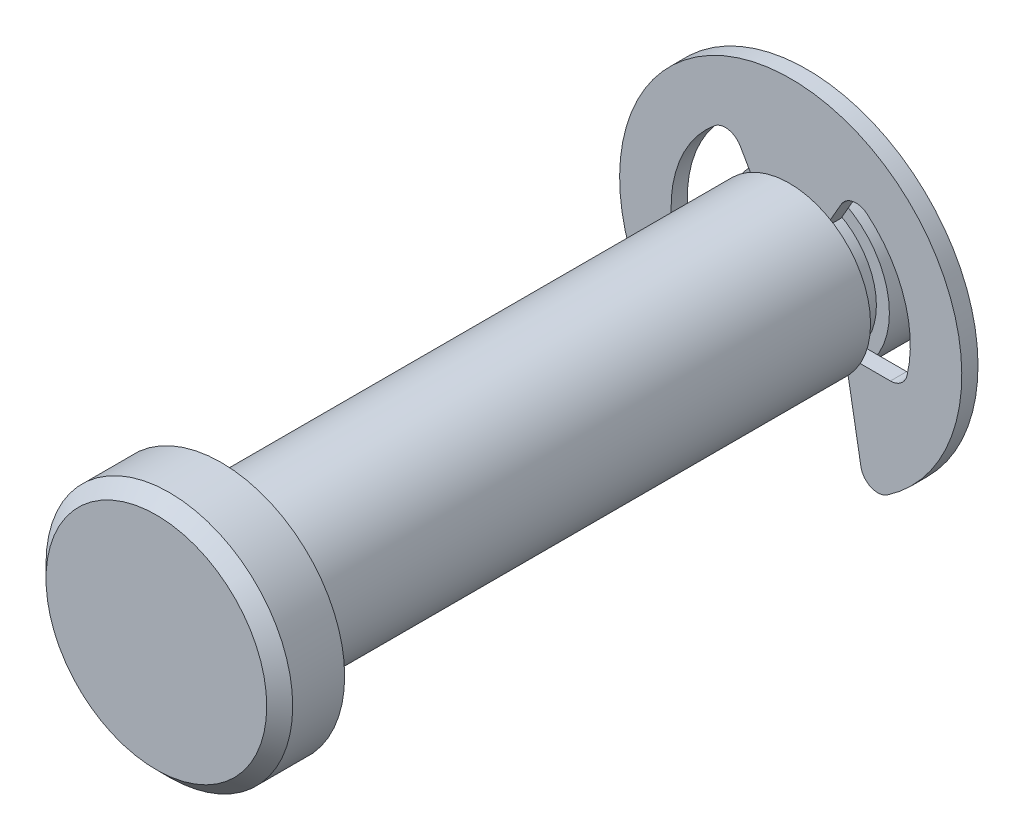
ISO-10303-21;
HEADER;
FILE_DESCRIPTION(('STEP AP214'),'2;1');
FILE_NAME('part.step','',(''),(''),'','','');
FILE_SCHEMA(('AUTOMOTIVE_DESIGN { 1 0 10303 214 1 1 1 1 }'));
ENDSEC;
DATA;
#1=APPLICATION_CONTEXT('core data for automotive mechanical design processes');
#2=APPLICATION_PROTOCOL_DEFINITION('international standard','automotive_design',2000,#1);
#3=PRODUCT_CONTEXT('',#1,'mechanical');
#4=PRODUCT('Part','Part','',(#3));
#5=PRODUCT_RELATED_PRODUCT_CATEGORY('part','',(#4));
#6=PRODUCT_DEFINITION_FORMATION('','',#4);
#7=PRODUCT_DEFINITION_CONTEXT('part definition',#1,'design');
#8=PRODUCT_DEFINITION('design','',#6,#7);
#9=PRODUCT_DEFINITION_SHAPE('','',#8);
#10=(LENGTH_UNIT() NAMED_UNIT(*) SI_UNIT(.MILLI.,.METRE.));
#11=(NAMED_UNIT(*) PLANE_ANGLE_UNIT() SI_UNIT($,.RADIAN.));
#12=(NAMED_UNIT(*) SI_UNIT($,.STERADIAN.) SOLID_ANGLE_UNIT());
#13=UNCERTAINTY_MEASURE_WITH_UNIT(LENGTH_MEASURE(1.E-05),#10,'distance_accuracy_value','');
#14=(GEOMETRIC_REPRESENTATION_CONTEXT(3) GLOBAL_UNCERTAINTY_ASSIGNED_CONTEXT((#13)) GLOBAL_UNIT_ASSIGNED_CONTEXT((#10,
#11,#12)) REPRESENTATION_CONTEXT('',''));
#15=CARTESIAN_POINT('',(0.,0.,0.));
#16=DIRECTION('',(0.,0.,1.));
#17=DIRECTION('',(1.,0.,0.));
#18=AXIS2_PLACEMENT_3D('',#15,#16,#17);
#19=CARTESIAN_POINT('',(0.,0.,-9.5758));
#20=DIRECTION('',(0.,0.,1.));
#21=DIRECTION('',(1.,0.,0.));
#22=AXIS2_PLACEMENT_3D('',#19,#20,#21);
#23=PLANE('',#22);
#24=DIRECTION('',(-0.173648177666931,0.984807753012208,0.));
#25=VECTOR('',#24,1.);
#26=CARTESIAN_POINT('',(1.79561377117954,0.316615154790629,-9.5758));
#27=LINE('',#26,#25);
#28=CARTESIAN_POINT('',(2.74784570227755,-5.08376048410501,-9.5758));
#29=VERTEX_POINT('',#28);
#30=CARTESIAN_POINT('',(2.1336,-1.6002,-9.5758));
#31=VERTEX_POINT('',#30);
#32=EDGE_CURVE('E199',#29,#31,#27,.T.);
#33=ORIENTED_EDGE('',*,*,#32,.F.);
#34=CARTESIAN_POINT('',(3.4069676832911,-4.96753949527431,-9.5758));
#35=DIRECTION('',(0.,0.,1.));
#36=DIRECTION('',(1.,0.,0.));
#37=AXIS2_PLACEMENT_3D('',#34,#35,#36);
#38=CIRCLE('',#37,0.66929);
#39=CARTESIAN_POINT('',(3.78551964810122,-5.51948832808256,-9.5758));
#40=VERTEX_POINT('',#39);
#41=EDGE_CURVE('E253',#29,#40,#38,.T.);
#42=ORIENTED_EDGE('',*,*,#41,.T.);
#43=CARTESIAN_POINT('',(0.,0.,-9.5758));
#44=DIRECTION('',(0.,0.,1.));
#45=DIRECTION('',(1.,0.,0.));
#46=AXIS2_PLACEMENT_3D('',#43,#44,#45);
#47=CIRCLE('',#46,6.6929);
#48=CARTESIAN_POINT('',(-3.78551964810122,-5.51948832808256,-9.5758));
#49=VERTEX_POINT('',#48);
#50=EDGE_CURVE('E179',#40,#49,#47,.T.);
#51=ORIENTED_EDGE('',*,*,#50,.T.);
#52=CARTESIAN_POINT('',(-3.4069676832911,-4.96753949527431,-9.5758));
#53=DIRECTION('',(0.,0.,1.));
#54=DIRECTION('',(1.,0.,0.));
#55=AXIS2_PLACEMENT_3D('',#52,#53,#54);
#56=CIRCLE('',#55,0.66929);
#57=CARTESIAN_POINT('',(-2.74784570227755,-5.08376048410501,-9.5758));
#58=VERTEX_POINT('',#57);
#59=EDGE_CURVE('E251',#49,#58,#56,.T.);
#60=ORIENTED_EDGE('',*,*,#59,.T.);
#61=DIRECTION('',(-0.173648177666931,-0.984807753012208,0.));
#62=VECTOR('',#61,1.);
#63=CARTESIAN_POINT('',(-1.79561377117954,0.316615154790629,-9.5758));
#64=LINE('',#63,#62);
#65=CARTESIAN_POINT('',(-2.1336,-1.6002,-9.5758));
#66=VERTEX_POINT('',#65);
#67=EDGE_CURVE('E195',#66,#58,#64,.T.);
#68=ORIENTED_EDGE('',*,*,#67,.F.);
#69=DIRECTION('',(1.,0.,0.));
#70=VECTOR('',#69,1.);
#71=CARTESIAN_POINT('',(0.,-1.6002,-9.5758));
#72=LINE('',#71,#70);
#73=CARTESIAN_POINT('',(-3.90112806858478,-1.6002,-9.5758));
#74=VERTEX_POINT('',#73);
#75=EDGE_CURVE('E186',#74,#66,#72,.T.);
#76=ORIENTED_EDGE('',*,*,#75,.F.);
#77=CARTESIAN_POINT('',(-3.90112806858478,-0.93091,-9.5758));
#78=DIRECTION('',(0.,0.,1.));
#79=DIRECTION('',(1.,0.,0.));
#80=AXIS2_PLACEMENT_3D('',#77,#78,#79);
#81=CIRCLE('',#80,0.66929);
#82=CARTESIAN_POINT('',(-4.55213962404525,-1.08625818556048,-9.5758));
#83=VERTEX_POINT('',#82);
#84=EDGE_CURVE('E51',#74,#83,#81,.F.);
#85=ORIENTED_EDGE('',*,*,#84,.T.);
#86=CARTESIAN_POINT('',(0.,0.,-9.5758));
#87=DIRECTION('',(0.,0.,1.));
#88=DIRECTION('',(1.,0.,0.));
#89=AXIS2_PLACEMENT_3D('',#86,#87,#88);
#90=CIRCLE('',#89,4.67995);
#91=CARTESIAN_POINT('',(-2.98351110662977,3.60563357527034,-9.5758));
#92=VERTEX_POINT('',#91);
#93=EDGE_CURVE('E211',#92,#83,#90,.T.);
#94=ORIENTED_EDGE('',*,*,#93,.F.);
#95=CARTESIAN_POINT('',(-2.55683258473184,3.08998394320319,-9.5758));
#96=DIRECTION('',(0.,0.,1.));
#97=DIRECTION('',(1.,0.,0.));
#98=AXIS2_PLACEMENT_3D('',#95,#96,#97);
#99=CIRCLE('',#98,0.66929);
#100=CARTESIAN_POINT('',(-1.97721044223295,3.42462894320319,-9.5758));
#101=VERTEX_POINT('',#100);
#102=EDGE_CURVE('E183',#92,#101,#99,.F.);
#103=ORIENTED_EDGE('',*,*,#102,.T.);
#104=DIRECTION('',(-0.500000000000001,0.866025403784438,0.));
#105=VECTOR('',#104,1.);
#106=CARTESIAN_POINT('',(0.,0.,-9.5758));
#107=LINE('',#106,#105);
#108=CARTESIAN_POINT('',(-1.3335,2.30968975189309,-9.5758));
#109=VERTEX_POINT('',#108);
#110=EDGE_CURVE('E175',#109,#101,#107,.T.);
#111=ORIENTED_EDGE('',*,*,#110,.F.);
#112=DIRECTION('',(1.,0.,0.));
#113=VECTOR('',#112,1.);
#114=CARTESIAN_POINT('',(-1.3335,2.30968975189309,-9.5758));
#115=LINE('',#114,#113);
#116=CARTESIAN_POINT('',(1.3335,2.30968975189309,-9.5758));
#117=VERTEX_POINT('',#116);
#118=EDGE_CURVE('E159',#109,#117,#115,.T.);
#119=ORIENTED_EDGE('',*,*,#118,.T.);
#120=DIRECTION('',(-0.500000000000001,-0.866025403784438,0.));
#121=VECTOR('',#120,1.);
#122=CARTESIAN_POINT('',(0.,0.,-9.5758));
#123=LINE('',#122,#121);
#124=CARTESIAN_POINT('',(1.97721044223295,3.42462894320319,-9.5758));
#125=VERTEX_POINT('',#124);
#126=EDGE_CURVE('E209',#125,#117,#123,.T.);
#127=ORIENTED_EDGE('',*,*,#126,.F.);
#128=CARTESIAN_POINT('',(2.55683258473184,3.08998394320319,-9.5758));
#129=DIRECTION('',(0.,0.,1.));
#130=DIRECTION('',(1.,0.,0.));
#131=AXIS2_PLACEMENT_3D('',#128,#129,#130);
#132=CIRCLE('',#131,0.66929);
#133=CARTESIAN_POINT('',(2.98351110662977,3.60563357527034,-9.5758));
#134=VERTEX_POINT('',#133);
#135=EDGE_CURVE('E268',#125,#134,#132,.F.);
#136=ORIENTED_EDGE('',*,*,#135,.T.);
#137=CARTESIAN_POINT('',(0.,0.,-9.5758));
#138=DIRECTION('',(0.,0.,1.));
#139=DIRECTION('',(1.,0.,0.));
#140=AXIS2_PLACEMENT_3D('',#137,#138,#139);
#141=CIRCLE('',#140,4.67995);
#142=CARTESIAN_POINT('',(4.55213962404525,-1.08625818556048,-9.5758));
#143=VERTEX_POINT('',#142);
#144=EDGE_CURVE('E214',#143,#134,#141,.T.);
#145=ORIENTED_EDGE('',*,*,#144,.F.);
#146=CARTESIAN_POINT('',(3.90112806858478,-0.93091,-9.5758));
#147=DIRECTION('',(0.,0.,1.));
#148=DIRECTION('',(1.,0.,0.));
#149=AXIS2_PLACEMENT_3D('',#146,#147,#148);
#150=CIRCLE('',#149,0.66929);
#151=CARTESIAN_POINT('',(3.90112806858478,-1.6002,-9.5758));
#152=VERTEX_POINT('',#151);
#153=EDGE_CURVE('E264',#143,#152,#150,.F.);
#154=ORIENTED_EDGE('',*,*,#153,.T.);
#155=DIRECTION('',(1.,0.,0.));
#156=VECTOR('',#155,1.);
#157=CARTESIAN_POINT('',(0.,-1.6002,-9.5758));
#158=LINE('',#157,#156);
#159=EDGE_CURVE('E204',#31,#152,#158,.T.);
#160=ORIENTED_EDGE('',*,*,#159,.F.);
#161=EDGE_LOOP('',(#33,#42,#51,#60,#68,#76,#85,#94,#103,#111,#119,#127,#136,#145,#154,#160));
#162=FACE_BOUND('',#161,.T.);
#163=ADVANCED_FACE('F43',(#162),#23,.T.);
#164=CARTESIAN_POINT('',(0.,0.,-10.2108));
#165=DIRECTION('',(0.,0.,1.));
#166=DIRECTION('',(1.,0.,0.));
#167=AXIS2_PLACEMENT_3D('',#164,#165,#166);
#168=PLANE('',#167);
#169=CARTESIAN_POINT('',(0.,0.,-10.2108));
#170=DIRECTION('',(0.,0.,1.));
#171=DIRECTION('',(1.,0.,0.));
#172=AXIS2_PLACEMENT_3D('',#169,#170,#171);
#173=CIRCLE('',#172,6.6929);
#174=CARTESIAN_POINT('',(3.78551964810122,-5.51948832808256,-10.2108));
#175=VERTEX_POINT('',#174);
#176=CARTESIAN_POINT('',(-3.78551964810122,-5.51948832808256,-10.2108));
#177=VERTEX_POINT('',#176);
#178=EDGE_CURVE('E217',#175,#177,#173,.T.);
#179=ORIENTED_EDGE('',*,*,#178,.F.);
#180=CARTESIAN_POINT('',(3.4069676832911,-4.96753949527431,-10.2108));
#181=DIRECTION('',(0.,0.,1.));
#182=DIRECTION('',(1.,0.,0.));
#183=AXIS2_PLACEMENT_3D('',#180,#181,#182);
#184=CIRCLE('',#183,0.66929);
#185=CARTESIAN_POINT('',(2.74784570227755,-5.08376048410501,-10.2108));
#186=VERTEX_POINT('',#185);
#187=EDGE_CURVE('E261',#175,#186,#184,.F.);
#188=ORIENTED_EDGE('',*,*,#187,.T.);
#189=DIRECTION('',(-0.173648177666931,0.984807753012208,0.));
#190=VECTOR('',#189,1.);
#191=CARTESIAN_POINT('',(1.79561377117954,0.316615154790629,-10.2108));
#192=LINE('',#191,#190);
#193=CARTESIAN_POINT('',(2.1336,-1.6002,-10.2108));
#194=VERTEX_POINT('',#193);
#195=EDGE_CURVE('E197',#186,#194,#192,.T.);
#196=ORIENTED_EDGE('',*,*,#195,.T.);
#197=DIRECTION('',(1.,0.,0.));
#198=VECTOR('',#197,1.);
#199=CARTESIAN_POINT('',(0.,-1.6002,-10.2108));
#200=LINE('',#199,#198);
#201=CARTESIAN_POINT('',(3.90112806858478,-1.6002,-10.2108));
#202=VERTEX_POINT('',#201);
#203=EDGE_CURVE('E201',#194,#202,#200,.T.);
#204=ORIENTED_EDGE('',*,*,#203,.T.);
#205=CARTESIAN_POINT('',(3.90112806858478,-0.93091,-10.2108));
#206=DIRECTION('',(0.,0.,1.));
#207=DIRECTION('',(1.,0.,0.));
#208=AXIS2_PLACEMENT_3D('',#205,#206,#207);
#209=CIRCLE('',#208,0.66929);
#210=CARTESIAN_POINT('',(4.55213962404525,-1.08625818556048,-10.2108));
#211=VERTEX_POINT('',#210);
#212=EDGE_CURVE('E266',#202,#211,#209,.T.);
#213=ORIENTED_EDGE('',*,*,#212,.T.);
#214=CARTESIAN_POINT('',(0.,0.,-10.2108));
#215=DIRECTION('',(0.,0.,1.));
#216=DIRECTION('',(1.,0.,0.));
#217=AXIS2_PLACEMENT_3D('',#214,#215,#216);
#218=CIRCLE('',#217,4.67995);
#219=CARTESIAN_POINT('',(2.98351110662977,3.60563357527034,-10.2108));
#220=VERTEX_POINT('',#219);
#221=EDGE_CURVE('E225',#211,#220,#218,.T.);
#222=ORIENTED_EDGE('',*,*,#221,.T.);
#223=CARTESIAN_POINT('',(2.55683258473184,3.08998394320319,-10.2108));
#224=DIRECTION('',(0.,0.,1.));
#225=DIRECTION('',(1.,0.,0.));
#226=AXIS2_PLACEMENT_3D('',#223,#224,#225);
#227=CIRCLE('',#226,0.66929);
#228=CARTESIAN_POINT('',(1.97721044223295,3.42462894320319,-10.2108));
#229=VERTEX_POINT('',#228);
#230=EDGE_CURVE('E270',#220,#229,#227,.T.);
#231=ORIENTED_EDGE('',*,*,#230,.T.);
#232=DIRECTION('',(-0.500000000000001,-0.866025403784438,0.));
#233=VECTOR('',#232,1.);
#234=CARTESIAN_POINT('',(0.,0.,-10.2108));
#235=LINE('',#234,#233);
#236=CARTESIAN_POINT('',(1.3335,2.30968975189309,-10.2108));
#237=VERTEX_POINT('',#236);
#238=EDGE_CURVE('E207',#229,#237,#235,.T.);
#239=ORIENTED_EDGE('',*,*,#238,.T.);
#240=DIRECTION('',(-1.,0.,0.));
#241=VECTOR('',#240,1.);
#242=CARTESIAN_POINT('',(-1.3335,2.30968975189309,-10.2108));
#243=LINE('',#242,#241);
#244=CARTESIAN_POINT('',(-1.3335,2.30968975189309,-10.2108));
#245=VERTEX_POINT('',#244);
#246=EDGE_CURVE('E170',#237,#245,#243,.T.);
#247=ORIENTED_EDGE('',*,*,#246,.T.);
#248=DIRECTION('',(-0.500000000000001,0.866025403784438,0.));
#249=VECTOR('',#248,1.);
#250=CARTESIAN_POINT('',(0.,0.,-10.2108));
#251=LINE('',#250,#249);
#252=CARTESIAN_POINT('',(-1.97721044223295,3.42462894320319,-10.2108));
#253=VERTEX_POINT('',#252);
#254=EDGE_CURVE('E178',#245,#253,#251,.T.);
#255=ORIENTED_EDGE('',*,*,#254,.T.);
#256=CARTESIAN_POINT('',(-2.55683258473184,3.08998394320319,-10.2108));
#257=DIRECTION('',(0.,0.,1.));
#258=DIRECTION('',(1.,0.,0.));
#259=AXIS2_PLACEMENT_3D('',#256,#257,#258);
#260=CIRCLE('',#259,0.66929);
#261=CARTESIAN_POINT('',(-2.98351110662977,3.60563357527034,-10.2108));
#262=VERTEX_POINT('',#261);
#263=EDGE_CURVE('E273',#253,#262,#260,.T.);
#264=ORIENTED_EDGE('',*,*,#263,.T.);
#265=CARTESIAN_POINT('',(0.,0.,-10.2108));
#266=DIRECTION('',(0.,0.,1.));
#267=DIRECTION('',(1.,0.,0.));
#268=AXIS2_PLACEMENT_3D('',#265,#266,#267);
#269=CIRCLE('',#268,4.67995);
#270=CARTESIAN_POINT('',(-4.55213962404525,-1.08625818556048,-10.2108));
#271=VERTEX_POINT('',#270);
#272=EDGE_CURVE('E222',#262,#271,#269,.T.);
#273=ORIENTED_EDGE('',*,*,#272,.T.);
#274=CARTESIAN_POINT('',(-3.90112806858478,-0.93091,-10.2108));
#275=DIRECTION('',(0.,0.,1.));
#276=DIRECTION('',(1.,0.,0.));
#277=AXIS2_PLACEMENT_3D('',#274,#275,#276);
#278=CIRCLE('',#277,0.66929);
#279=CARTESIAN_POINT('',(-3.90112806858478,-1.6002,-10.2108));
#280=VERTEX_POINT('',#279);
#281=EDGE_CURVE('E13',#271,#280,#278,.T.);
#282=ORIENTED_EDGE('',*,*,#281,.T.);
#283=DIRECTION('',(1.,0.,0.));
#284=VECTOR('',#283,1.);
#285=CARTESIAN_POINT('',(0.,-1.6002,-10.2108));
#286=LINE('',#285,#284);
#287=CARTESIAN_POINT('',(-2.1336,-1.6002,-10.2108));
#288=VERTEX_POINT('',#287);
#289=EDGE_CURVE('E184',#280,#288,#286,.T.);
#290=ORIENTED_EDGE('',*,*,#289,.T.);
#291=DIRECTION('',(-0.173648177666931,-0.984807753012208,0.));
#292=VECTOR('',#291,1.);
#293=CARTESIAN_POINT('',(-1.79561377117954,0.316615154790629,-10.2108));
#294=LINE('',#293,#292);
#295=CARTESIAN_POINT('',(-2.74784570227755,-5.08376048410501,-10.2108));
#296=VERTEX_POINT('',#295);
#297=EDGE_CURVE('E193',#288,#296,#294,.T.);
#298=ORIENTED_EDGE('',*,*,#297,.T.);
#299=CARTESIAN_POINT('',(-3.4069676832911,-4.96753949527431,-10.2108));
#300=DIRECTION('',(0.,0.,1.));
#301=DIRECTION('',(1.,0.,0.));
#302=AXIS2_PLACEMENT_3D('',#299,#300,#301);
#303=CIRCLE('',#302,0.66929);
#304=EDGE_CURVE('E65',#296,#177,#303,.F.);
#305=ORIENTED_EDGE('',*,*,#304,.T.);
#306=EDGE_LOOP('',(#179,#188,#196,#204,#213,#222,#231,#239,#247,#255,#264,#273,#282,#290,#298,#305));
#307=FACE_BOUND('',#306,.T.);
#308=ADVANCED_FACE('F286',(#307),#168,.F.);
#309=CARTESIAN_POINT('',(0.,0.,-9.5758));
#310=DIRECTION('',(0.,0.,-1.));
#311=DIRECTION('',(-1.,0.,0.));
#312=AXIS2_PLACEMENT_3D('',#309,#310,#311);
#313=CYLINDRICAL_SURFACE('',#312,6.6929);
#314=ORIENTED_EDGE('',*,*,#50,.F.);
#315=DIRECTION('',(0.,0.,-1.));
#316=VECTOR('',#315,1.);
#317=CARTESIAN_POINT('',(3.78551964810122,-5.51948832808256,-9.5758));
#318=LINE('',#317,#316);
#319=EDGE_CURVE('E258',#40,#175,#318,.T.);
#320=ORIENTED_EDGE('',*,*,#319,.T.);
#321=ORIENTED_EDGE('',*,*,#178,.T.);
#322=DIRECTION('',(0.,0.,-1.));
#323=VECTOR('',#322,1.);
#324=CARTESIAN_POINT('',(-3.78551964810122,-5.51948832808256,-9.5758));
#325=LINE('',#324,#323);
#326=EDGE_CURVE('E255',#177,#49,#325,.F.);
#327=ORIENTED_EDGE('',*,*,#326,.T.);
#328=EDGE_LOOP('',(#314,#320,#321,#327));
#329=FACE_BOUND('',#328,.T.);
#330=ADVANCED_FACE('F326',(#329),#313,.T.);
#331=CARTESIAN_POINT('',(-2.1336,-1.6002,-12.7));
#332=DIRECTION('',(-0.984807753012208,0.173648177666931,0.));
#333=DIRECTION('',(-0.173648177666931,-0.984807753012208,0.));
#334=AXIS2_PLACEMENT_3D('',#331,#332,#333);
#335=PLANE('',#334);
#336=ORIENTED_EDGE('',*,*,#67,.T.);
#337=DIRECTION('',(0.,0.,-1.));
#338=VECTOR('',#337,1.);
#339=CARTESIAN_POINT('',(-2.74784570227755,-5.08376048410501,-12.7));
#340=LINE('',#339,#338);
#341=EDGE_CURVE('E58',#58,#296,#340,.T.);
#342=ORIENTED_EDGE('',*,*,#341,.T.);
#343=ORIENTED_EDGE('',*,*,#297,.F.);
#344=DIRECTION('',(0.,0.,1.));
#345=VECTOR('',#344,1.);
#346=CARTESIAN_POINT('',(-2.1336,-1.6002,-12.7));
#347=LINE('',#346,#345);
#348=EDGE_CURVE('E291',#288,#66,#347,.T.);
#349=ORIENTED_EDGE('',*,*,#348,.T.);
#350=EDGE_LOOP('',(#336,#342,#343,#349));
#351=FACE_BOUND('',#350,.T.);
#352=ADVANCED_FACE('F331',(#351),#335,.F.);
#353=CARTESIAN_POINT('',(-2.33997500000001,4.05295558844098,-12.7));
#354=DIRECTION('',(0.866025403784438,0.500000000000001,0.));
#355=DIRECTION('',(-0.500000000000001,0.866025403784438,0.));
#356=AXIS2_PLACEMENT_3D('',#353,#354,#355);
#357=PLANE('',#356);
#358=ORIENTED_EDGE('',*,*,#110,.T.);
#359=DIRECTION('',(0.,0.,-1.));
#360=VECTOR('',#359,1.);
#361=CARTESIAN_POINT('',(-1.97721044223295,3.42462894320319,-10.2108));
#362=LINE('',#361,#360);
#363=EDGE_CURVE('E243',#101,#253,#362,.T.);
#364=ORIENTED_EDGE('',*,*,#363,.T.);
#365=ORIENTED_EDGE('',*,*,#254,.F.);
#366=DIRECTION('',(0.,0.,-1.));
#367=VECTOR('',#366,1.);
#368=CARTESIAN_POINT('',(-1.3335,2.30968975189309,-9.5758));
#369=LINE('',#368,#367);
#370=EDGE_CURVE('E163',#245,#109,#369,.F.);
#371=ORIENTED_EDGE('',*,*,#370,.T.);
#372=EDGE_LOOP('',(#358,#364,#365,#371));
#373=FACE_BOUND('',#372,.T.);
#374=ADVANCED_FACE('F174',(#373),#357,.F.);
#375=CARTESIAN_POINT('',(0.,0.,-12.7));
#376=DIRECTION('',(0.,0.,1.));
#377=DIRECTION('',(1.,0.,0.));
#378=AXIS2_PLACEMENT_3D('',#375,#376,#377);
#379=CYLINDRICAL_SURFACE('',#378,4.67995);
#380=ORIENTED_EDGE('',*,*,#272,.F.);
#381=DIRECTION('',(0.,0.,1.));
#382=VECTOR('',#381,1.);
#383=CARTESIAN_POINT('',(-2.98351110662977,3.60563357527034,-12.7));
#384=LINE('',#383,#382);
#385=EDGE_CURVE('E240',#262,#92,#384,.T.);
#386=ORIENTED_EDGE('',*,*,#385,.T.);
#387=ORIENTED_EDGE('',*,*,#93,.T.);
#388=DIRECTION('',(0.,0.,1.));
#389=VECTOR('',#388,1.);
#390=CARTESIAN_POINT('',(-4.55213962404525,-1.08625818556048,-12.7));
#391=LINE('',#390,#389);
#392=EDGE_CURVE('E238',#83,#271,#391,.F.);
#393=ORIENTED_EDGE('',*,*,#392,.T.);
#394=EDGE_LOOP('',(#380,#386,#387,#393));
#395=FACE_BOUND('',#394,.T.);
#396=ADVANCED_FACE('F281',(#395),#379,.F.);
#397=CARTESIAN_POINT('',(-4.39787357281903,-1.6002,-12.7));
#398=DIRECTION('',(0.,-1.,0.));
#399=DIRECTION('',(0.,0.,-1.));
#400=AXIS2_PLACEMENT_3D('',#397,#398,#399);
#401=PLANE('',#400);
#402=ORIENTED_EDGE('',*,*,#289,.F.);
#403=DIRECTION('',(0.,0.,-1.));
#404=VECTOR('',#403,1.);
#405=CARTESIAN_POINT('',(-3.90112806858478,-1.6002,-9.5758));
#406=LINE('',#405,#404);
#407=EDGE_CURVE('E245',#280,#74,#406,.F.);
#408=ORIENTED_EDGE('',*,*,#407,.T.);
#409=ORIENTED_EDGE('',*,*,#75,.T.);
#410=ORIENTED_EDGE('',*,*,#348,.F.);
#411=EDGE_LOOP('',(#402,#408,#409,#410));
#412=FACE_BOUND('',#411,.T.);
#413=ADVANCED_FACE('F289',(#412),#401,.F.);
#414=CARTESIAN_POINT('',(0.,0.,-12.7));
#415=DIRECTION('',(0.,0.,1.));
#416=DIRECTION('',(1.,0.,0.));
#417=AXIS2_PLACEMENT_3D('',#414,#415,#416);
#418=CYLINDRICAL_SURFACE('',#417,4.67995);
#419=ORIENTED_EDGE('',*,*,#221,.F.);
#420=DIRECTION('',(0.,0.,1.));
#421=VECTOR('',#420,1.);
#422=CARTESIAN_POINT('',(4.55213962404525,-1.08625818556048,-12.7));
#423=LINE('',#422,#421);
#424=EDGE_CURVE('E230',#211,#143,#423,.T.);
#425=ORIENTED_EDGE('',*,*,#424,.T.);
#426=ORIENTED_EDGE('',*,*,#144,.T.);
#427=DIRECTION('',(0.,0.,1.));
#428=VECTOR('',#427,1.);
#429=CARTESIAN_POINT('',(2.98351110662977,3.60563357527034,-12.7));
#430=LINE('',#429,#428);
#431=EDGE_CURVE('E228',#134,#220,#430,.F.);
#432=ORIENTED_EDGE('',*,*,#431,.T.);
#433=EDGE_LOOP('',(#419,#425,#426,#432));
#434=FACE_BOUND('',#433,.T.);
#435=ADVANCED_FACE('F305',(#434),#418,.F.);
#436=CARTESIAN_POINT('',(2.1336,-1.6002,-12.7));
#437=DIRECTION('',(0.,-1.,0.));
#438=DIRECTION('',(0.,0.,-1.));
#439=AXIS2_PLACEMENT_3D('',#436,#437,#438);
#440=PLANE('',#439);
#441=ORIENTED_EDGE('',*,*,#159,.T.);
#442=DIRECTION('',(0.,0.,-1.));
#443=VECTOR('',#442,1.);
#444=CARTESIAN_POINT('',(3.90112806858478,-1.6002,-10.2108));
#445=LINE('',#444,#443);
#446=EDGE_CURVE('E233',#152,#202,#445,.T.);
#447=ORIENTED_EDGE('',*,*,#446,.T.);
#448=ORIENTED_EDGE('',*,*,#203,.F.);
#449=DIRECTION('',(0.,0.,1.));
#450=VECTOR('',#449,1.);
#451=CARTESIAN_POINT('',(2.1336,-1.6002,-12.7));
#452=LINE('',#451,#450);
#453=EDGE_CURVE('E188',#194,#31,#452,.T.);
#454=ORIENTED_EDGE('',*,*,#453,.T.);
#455=EDGE_LOOP('',(#441,#447,#448,#454));
#456=FACE_BOUND('',#455,.T.);
#457=ADVANCED_FACE('F315',(#456),#440,.F.);
#458=CARTESIAN_POINT('',(2.1336,-1.6002,-12.7));
#459=DIRECTION('',(0.984807753012208,0.173648177666931,0.));
#460=DIRECTION('',(-0.173648177666931,0.984807753012208,0.));
#461=AXIS2_PLACEMENT_3D('',#458,#459,#460);
#462=PLANE('',#461);
#463=ORIENTED_EDGE('',*,*,#195,.F.);
#464=DIRECTION('',(0.,0.,-1.));
#465=VECTOR('',#464,1.);
#466=CARTESIAN_POINT('',(2.74784570227755,-5.08376048410501,-12.7));
#467=LINE('',#466,#465);
#468=EDGE_CURVE('E248',#186,#29,#467,.F.);
#469=ORIENTED_EDGE('',*,*,#468,.T.);
#470=ORIENTED_EDGE('',*,*,#32,.T.);
#471=ORIENTED_EDGE('',*,*,#453,.F.);
#472=EDGE_LOOP('',(#463,#469,#470,#471));
#473=FACE_BOUND('',#472,.T.);
#474=ADVANCED_FACE('F320',(#473),#462,.F.);
#475=CARTESIAN_POINT('',(0.,0.,-12.7));
#476=DIRECTION('',(-0.866025403784438,0.500000000000001,0.));
#477=DIRECTION('',(-0.500000000000001,-0.866025403784438,0.));
#478=AXIS2_PLACEMENT_3D('',#475,#476,#477);
#479=PLANE('',#478);
#480=ORIENTED_EDGE('',*,*,#238,.F.);
#481=DIRECTION('',(0.,0.,-1.));
#482=VECTOR('',#481,1.);
#483=CARTESIAN_POINT('',(1.97721044223295,3.42462894320319,-9.5758));
#484=LINE('',#483,#482);
#485=EDGE_CURVE('E235',#229,#125,#484,.F.);
#486=ORIENTED_EDGE('',*,*,#485,.T.);
#487=ORIENTED_EDGE('',*,*,#126,.T.);
#488=DIRECTION('',(0.,0.,-1.));
#489=VECTOR('',#488,1.);
#490=CARTESIAN_POINT('',(1.3335,2.30968975189309,-9.5758));
#491=LINE('',#490,#489);
#492=EDGE_CURVE('E166',#117,#237,#491,.T.);
#493=ORIENTED_EDGE('',*,*,#492,.T.);
#494=EDGE_LOOP('',(#480,#486,#487,#493));
#495=FACE_BOUND('',#494,.T.);
#496=ADVANCED_FACE('F298',(#495),#479,.F.);
#497=CARTESIAN_POINT('',(-1.3335,2.30968975189309,-12.9016287967469));
#498=DIRECTION('',(0.,-1.,0.));
#499=DIRECTION('',(0.,0.,-1.));
#500=AXIS2_PLACEMENT_3D('',#497,#498,#499);
#501=PLANE('',#500);
#502=ORIENTED_EDGE('',*,*,#246,.F.);
#503=ORIENTED_EDGE('',*,*,#492,.F.);
#504=ORIENTED_EDGE('',*,*,#118,.F.);
#505=ORIENTED_EDGE('',*,*,#370,.F.);
#506=EDGE_LOOP('',(#502,#503,#504,#505));
#507=FACE_BOUND('',#506,.T.);
#508=ADVANCED_FACE('F162',(#507),#501,.T.);
#509=CARTESIAN_POINT('',(3.90112806858478,-0.93091,-12.7));
#510=DIRECTION('',(0.,0.,1.));
#511=DIRECTION('',(1.,0.,0.));
#512=AXIS2_PLACEMENT_3D('',#509,#510,#511);
#513=CYLINDRICAL_SURFACE('',#512,0.66929);
#514=ORIENTED_EDGE('',*,*,#212,.F.);
#515=ORIENTED_EDGE('',*,*,#446,.F.);
#516=ORIENTED_EDGE('',*,*,#153,.F.);
#517=ORIENTED_EDGE('',*,*,#424,.F.);
#518=EDGE_LOOP('',(#514,#515,#516,#517));
#519=FACE_BOUND('',#518,.T.);
#520=ADVANCED_FACE('F311',(#519),#513,.F.);
#521=CARTESIAN_POINT('',(2.55683258473184,3.08998394320319,-12.7));
#522=DIRECTION('',(0.,0.,1.));
#523=DIRECTION('',(1.,0.,0.));
#524=AXIS2_PLACEMENT_3D('',#521,#522,#523);
#525=CYLINDRICAL_SURFACE('',#524,0.66929);
#526=ORIENTED_EDGE('',*,*,#230,.F.);
#527=ORIENTED_EDGE('',*,*,#431,.F.);
#528=ORIENTED_EDGE('',*,*,#135,.F.);
#529=ORIENTED_EDGE('',*,*,#485,.F.);
#530=EDGE_LOOP('',(#526,#527,#528,#529));
#531=FACE_BOUND('',#530,.T.);
#532=ADVANCED_FACE('F308',(#531),#525,.F.);
#533=CARTESIAN_POINT('',(-2.55683258473184,3.08998394320319,-12.7));
#534=DIRECTION('',(0.,0.,1.));
#535=DIRECTION('',(1.,0.,0.));
#536=AXIS2_PLACEMENT_3D('',#533,#534,#535);
#537=CYLINDRICAL_SURFACE('',#536,0.66929);
#538=ORIENTED_EDGE('',*,*,#263,.F.);
#539=ORIENTED_EDGE('',*,*,#363,.F.);
#540=ORIENTED_EDGE('',*,*,#102,.F.);
#541=ORIENTED_EDGE('',*,*,#385,.F.);
#542=EDGE_LOOP('',(#538,#539,#540,#541));
#543=FACE_BOUND('',#542,.T.);
#544=ADVANCED_FACE('F354',(#543),#537,.F.);
#545=CARTESIAN_POINT('',(-3.90112806858478,-0.93091,-12.7));
#546=DIRECTION('',(0.,0.,1.));
#547=DIRECTION('',(1.,0.,0.));
#548=AXIS2_PLACEMENT_3D('',#545,#546,#547);
#549=CYLINDRICAL_SURFACE('',#548,0.66929);
#550=ORIENTED_EDGE('',*,*,#281,.F.);
#551=ORIENTED_EDGE('',*,*,#392,.F.);
#552=ORIENTED_EDGE('',*,*,#84,.F.);
#553=ORIENTED_EDGE('',*,*,#407,.F.);
#554=EDGE_LOOP('',(#550,#551,#552,#553));
#555=FACE_BOUND('',#554,.T.);
#556=ADVANCED_FACE('F284',(#555),#549,.F.);
#557=CARTESIAN_POINT('',(3.4069676832911,-4.96753949527431,-9.5758));
#558=DIRECTION('',(0.,0.,-1.));
#559=DIRECTION('',(-1.,0.,0.));
#560=AXIS2_PLACEMENT_3D('',#557,#558,#559);
#561=CYLINDRICAL_SURFACE('',#560,0.66929);
#562=ORIENTED_EDGE('',*,*,#187,.F.);
#563=ORIENTED_EDGE('',*,*,#319,.F.);
#564=ORIENTED_EDGE('',*,*,#41,.F.);
#565=ORIENTED_EDGE('',*,*,#468,.F.);
#566=EDGE_LOOP('',(#562,#563,#564,#565));
#567=FACE_BOUND('',#566,.T.);
#568=ADVANCED_FACE('F329',(#567),#561,.T.);
#569=CARTESIAN_POINT('',(-3.4069676832911,-4.96753949527431,-9.5758));
#570=DIRECTION('',(0.,0.,-1.));
#571=DIRECTION('',(-1.,0.,0.));
#572=AXIS2_PLACEMENT_3D('',#569,#570,#571);
#573=CYLINDRICAL_SURFACE('',#572,0.66929);
#574=ORIENTED_EDGE('',*,*,#304,.F.);
#575=ORIENTED_EDGE('',*,*,#341,.F.);
#576=ORIENTED_EDGE('',*,*,#59,.F.);
#577=ORIENTED_EDGE('',*,*,#326,.F.);
#578=EDGE_LOOP('',(#574,#575,#576,#577));
#579=FACE_BOUND('',#578,.T.);
#580=ADVANCED_FACE('F45',(#579),#573,.T.);
#581=CLOSED_SHELL('',(#163,#308,#330,#352,#374,#396,#413,#435,#457,#474,#496,#508,#520,#532,
#544,#556,#568,#580));
#582=MANIFOLD_SOLID_BREP('B2',#581);
#583=CARTESIAN_POINT('',(0.,0.,12.7));
#584=DIRECTION('',(0.,0.,-1.));
#585=DIRECTION('',(-1.,0.,0.));
#586=AXIS2_PLACEMENT_3D('',#583,#584,#585);
#587=CYLINDRICAL_SURFACE('',#586,3.175);
#588=CARTESIAN_POINT('',(0.,0.,12.7));
#589=DIRECTION('',(0.,0.,1.));
#590=DIRECTION('',(1.,0.,0.));
#591=AXIS2_PLACEMENT_3D('',#588,#589,#590);
#592=CIRCLE('',#591,3.175);
#593=CARTESIAN_POINT('',(3.175,0.,12.7));
#594=VERTEX_POINT('',#593);
#595=EDGE_CURVE('E504',#594,#594,#592,.T.);
#596=ORIENTED_EDGE('',*,*,#595,.F.);
#597=EDGE_LOOP('',(#596));
#598=FACE_BOUND('',#597,.T.);
#599=CARTESIAN_POINT('',(0.,0.,-9.525));
#600=DIRECTION('',(0.,0.,1.));
#601=DIRECTION('',(1.,0.,0.));
#602=AXIS2_PLACEMENT_3D('',#599,#600,#601);
#603=CIRCLE('',#602,3.175);
#604=CARTESIAN_POINT('',(3.175,0.,-9.525));
#605=VERTEX_POINT('',#604);
#606=EDGE_CURVE('E516',#605,#605,#603,.T.);
#607=ORIENTED_EDGE('',*,*,#606,.T.);
#608=EDGE_LOOP('',(#607));
#609=FACE_BOUND('',#608,.T.);
#610=ADVANCED_FACE('F484',(#598,#609),#587,.T.);
#611=CARTESIAN_POINT('',(0.,3.175,-9.525));
#612=DIRECTION('',(0.,0.,-1.));
#613=DIRECTION('',(-1.,0.,0.));
#614=AXIS2_PLACEMENT_3D('',#611,#612,#613);
#615=PLANE('',#614);
#616=CARTESIAN_POINT('',(0.,0.,-9.525));
#617=DIRECTION('',(0.,0.,1.));
#618=DIRECTION('',(1.,0.,0.));
#619=AXIS2_PLACEMENT_3D('',#616,#617,#618);
#620=CIRCLE('',#619,2.667);
#621=CARTESIAN_POINT('',(2.667,0.,-9.525));
#622=VERTEX_POINT('',#621);
#623=EDGE_CURVE('E507',#622,#622,#620,.T.);
#624=ORIENTED_EDGE('',*,*,#623,.T.);
#625=EDGE_LOOP('',(#624));
#626=FACE_BOUND('',#625,.T.);
#627=ORIENTED_EDGE('',*,*,#606,.F.);
#628=EDGE_LOOP('',(#627));
#629=FACE_BOUND('',#628,.T.);
#630=ADVANCED_FACE('F534',(#626,#629),#615,.T.);
#631=CARTESIAN_POINT('',(0.,0.,12.7));
#632=DIRECTION('',(0.,0.,1.));
#633=DIRECTION('',(1.,0.,0.));
#634=AXIS2_PLACEMENT_3D('',#631,#632,#633);
#635=CYLINDRICAL_SURFACE('',#634,2.667);
#636=CARTESIAN_POINT('',(0.,0.,-10.2616));
#637=DIRECTION('',(0.,0.,1.));
#638=DIRECTION('',(1.,0.,0.));
#639=AXIS2_PLACEMENT_3D('',#636,#637,#638);
#640=CIRCLE('',#639,2.667);
#641=CARTESIAN_POINT('',(2.667,0.,-10.2616));
#642=VERTEX_POINT('',#641);
#643=EDGE_CURVE('E510',#642,#642,#640,.T.);
#644=ORIENTED_EDGE('',*,*,#643,.T.);
#645=EDGE_LOOP('',(#644));
#646=FACE_BOUND('',#645,.T.);
#647=ORIENTED_EDGE('',*,*,#623,.F.);
#648=EDGE_LOOP('',(#647));
#649=FACE_BOUND('',#648,.T.);
#650=ADVANCED_FACE('F539',(#646,#649),#635,.T.);
#651=CARTESIAN_POINT('',(0.,3.175,-10.2616));
#652=DIRECTION('',(0.,0.,1.));
#653=DIRECTION('',(1.,0.,0.));
#654=AXIS2_PLACEMENT_3D('',#651,#652,#653);
#655=PLANE('',#654);
#656=CARTESIAN_POINT('',(0.,0.,-10.2616));
#657=DIRECTION('',(0.,0.,1.));
#658=DIRECTION('',(1.,0.,0.));
#659=AXIS2_PLACEMENT_3D('',#656,#657,#658);
#660=CIRCLE('',#659,3.175);
#661=CARTESIAN_POINT('',(3.175,0.,-10.2616));
#662=VERTEX_POINT('',#661);
#663=EDGE_CURVE('E513',#662,#662,#660,.T.);
#664=ORIENTED_EDGE('',*,*,#663,.T.);
#665=EDGE_LOOP('',(#664));
#666=FACE_BOUND('',#665,.T.);
#667=ORIENTED_EDGE('',*,*,#643,.F.);
#668=EDGE_LOOP('',(#667));
#669=FACE_BOUND('',#668,.T.);
#670=ADVANCED_FACE('F545',(#666,#669),#655,.T.);
#671=CARTESIAN_POINT('',(0.,0.,-12.7));
#672=DIRECTION('',(0.,0.,1.));
#673=DIRECTION('',(1.,0.,0.));
#674=AXIS2_PLACEMENT_3D('',#671,#672,#673);
#675=PLANE('',#674);
#676=CARTESIAN_POINT('',(0.,0.,-12.7));
#677=DIRECTION('',(0.,0.,1.));
#678=DIRECTION('',(1.,0.,0.));
#679=AXIS2_PLACEMENT_3D('',#676,#677,#678);
#680=CIRCLE('',#679,2.54000000000001);
#681=CARTESIAN_POINT('',(2.54000000000001,0.,-12.7));
#682=VERTEX_POINT('',#681);
#683=EDGE_CURVE('E42',#682,#682,#680,.F.);
#684=ORIENTED_EDGE('',*,*,#683,.T.);
#685=EDGE_LOOP('',(#684));
#686=FACE_BOUND('',#685,.T.);
#687=ADVANCED_FACE('F550',(#686),#675,.F.);
#688=CARTESIAN_POINT('',(0.,0.,-12.065));
#689=DIRECTION('',(0.,0.,1.));
#690=DIRECTION('',(1.,0.,0.));
#691=AXIS2_PLACEMENT_3D('',#688,#689,#690);
#692=CIRCLE('',#691,3.175);
#693=CARTESIAN_POINT('',(3.175,0.,-12.065));
#694=VERTEX_POINT('',#693);
#695=EDGE_CURVE('E491',#694,#694,#692,.T.);
#696=ORIENTED_EDGE('',*,*,#695,.T.);
#697=EDGE_LOOP('',(#696));
#698=FACE_BOUND('',#697,.T.);
#699=ORIENTED_EDGE('',*,*,#663,.F.);
#700=EDGE_LOOP('',(#699));
#701=FACE_BOUND('',#700,.T.);
#702=ADVANCED_FACE('F528',(#698,#701),#587,.T.);
#703=CARTESIAN_POINT('',(0.,0.,12.7));
#704=DIRECTION('',(0.,0.,1.));
#705=DIRECTION('',(1.,0.,0.));
#706=AXIS2_PLACEMENT_3D('',#703,#704,#705);
#707=PLANE('',#706);
#708=CARTESIAN_POINT('',(0.,0.,12.7));
#709=DIRECTION('',(0.,0.,1.));
#710=DIRECTION('',(1.,0.,0.));
#711=AXIS2_PLACEMENT_3D('',#708,#709,#710);
#712=CIRCLE('',#711,4.826);
#713=CARTESIAN_POINT('',(4.826,0.,12.7));
#714=VERTEX_POINT('',#713);
#715=EDGE_CURVE('E519',#714,#714,#712,.T.);
#716=ORIENTED_EDGE('',*,*,#715,.F.);
#717=EDGE_LOOP('',(#716));
#718=FACE_BOUND('',#717,.T.);
#719=ORIENTED_EDGE('',*,*,#595,.T.);
#720=EDGE_LOOP('',(#719));
#721=FACE_BOUND('',#720,.T.);
#722=ADVANCED_FACE('F525',(#718,#721),#707,.F.);
#723=CARTESIAN_POINT('',(0.,0.,15.24));
#724=DIRECTION('',(0.,0.,-1.));
#725=DIRECTION('',(-1.,0.,0.));
#726=AXIS2_PLACEMENT_3D('',#723,#724,#725);
#727=CYLINDRICAL_SURFACE('',#726,4.826);
#728=CARTESIAN_POINT('',(0.,0.,14.732));
#729=DIRECTION('',(0.,0.,1.));
#730=DIRECTION('',(1.,0.,0.));
#731=AXIS2_PLACEMENT_3D('',#728,#729,#730);
#732=CIRCLE('',#731,4.826);
#733=CARTESIAN_POINT('',(4.826,0.,14.732));
#734=VERTEX_POINT('',#733);
#735=EDGE_CURVE('E495',#734,#734,#732,.F.);
#736=ORIENTED_EDGE('',*,*,#735,.T.);
#737=EDGE_LOOP('',(#736));
#738=FACE_BOUND('',#737,.T.);
#739=ORIENTED_EDGE('',*,*,#715,.T.);
#740=EDGE_LOOP('',(#739));
#741=FACE_BOUND('',#740,.T.);
#742=ADVANCED_FACE('F523',(#738,#741),#727,.T.);
#743=CARTESIAN_POINT('',(0.,0.,15.24));
#744=DIRECTION('',(0.,0.,1.));
#745=DIRECTION('',(1.,0.,0.));
#746=AXIS2_PLACEMENT_3D('',#743,#744,#745);
#747=PLANE('',#746);
#748=CARTESIAN_POINT('',(0.,0.,15.24));
#749=DIRECTION('',(0.,0.,1.));
#750=DIRECTION('',(1.,0.,0.));
#751=AXIS2_PLACEMENT_3D('',#748,#749,#750);
#752=CIRCLE('',#751,4.31799999999999);
#753=CARTESIAN_POINT('',(4.31799999999999,0.,15.24));
#754=VERTEX_POINT('',#753);
#755=EDGE_CURVE('E499',#754,#754,#752,.T.);
#756=ORIENTED_EDGE('',*,*,#755,.T.);
#757=EDGE_LOOP('',(#756));
#758=FACE_BOUND('',#757,.T.);
#759=ADVANCED_FACE('F554',(#758),#747,.T.);
#760=CARTESIAN_POINT('',(0.,0.,15.24));
#761=DIRECTION('',(0.,0.,-1.));
#762=DIRECTION('',(-1.,0.,0.));
#763=AXIS2_PLACEMENT_3D('',#760,#761,#762);
#764=CONICAL_SURFACE('',#763,4.31799999999999,0.785398163397444);
#765=ORIENTED_EDGE('',*,*,#735,.F.);
#766=EDGE_LOOP('',(#765));
#767=FACE_BOUND('',#766,.T.);
#768=ORIENTED_EDGE('',*,*,#755,.F.);
#769=EDGE_LOOP('',(#768));
#770=FACE_BOUND('',#769,.T.);
#771=ADVANCED_FACE('F552',(#767,#770),#764,.T.);
#772=CARTESIAN_POINT('',(0.,0.,-12.065));
#773=DIRECTION('',(0.,0.,1.));
#774=DIRECTION('',(1.,0.,0.));
#775=AXIS2_PLACEMENT_3D('',#772,#773,#774);
#776=CONICAL_SURFACE('',#775,3.175,0.785398163397447);
#777=ORIENTED_EDGE('',*,*,#683,.F.);
#778=EDGE_LOOP('',(#777));
#779=FACE_BOUND('',#778,.T.);
#780=ORIENTED_EDGE('',*,*,#695,.F.);
#781=EDGE_LOOP('',(#780));
#782=FACE_BOUND('',#781,.T.);
#783=ADVANCED_FACE('F486',(#779,#782),#776,.T.);
#784=CLOSED_SHELL('',(#610,#630,#650,#670,#687,#702,#722,#742,#759,#771,#783));
#785=MANIFOLD_SOLID_BREP('B7',#784);
#786=ADVANCED_BREP_SHAPE_REPRESENTATION('',(#18,#582,#785),#14);
#787=SHAPE_DEFINITION_REPRESENTATION(#9,#786);
ENDSEC;
END-ISO-10303-21;
